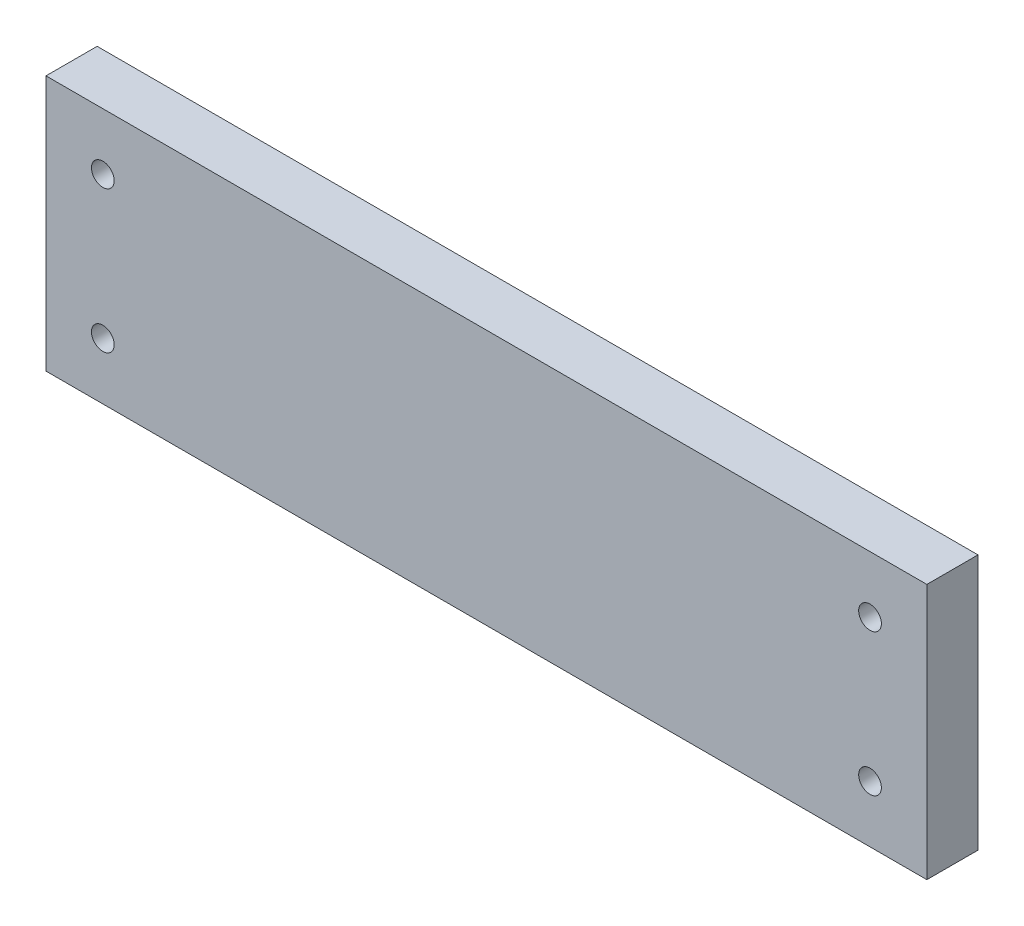
ISO-10303-21;
HEADER;
FILE_DESCRIPTION(('STEP AP214'),'2;1');
FILE_NAME('part.step','',(''),(''),'','','');
FILE_SCHEMA(('AUTOMOTIVE_DESIGN { 1 0 10303 214 1 1 1 1 }'));
ENDSEC;
DATA;
#1=APPLICATION_CONTEXT('core data for automotive mechanical design processes');
#2=APPLICATION_PROTOCOL_DEFINITION('international standard','automotive_design',2000,#1);
#3=PRODUCT_CONTEXT('',#1,'mechanical');
#4=PRODUCT('Part','Part','',(#3));
#5=PRODUCT_RELATED_PRODUCT_CATEGORY('part','',(#4));
#6=PRODUCT_DEFINITION_FORMATION('','',#4);
#7=PRODUCT_DEFINITION_CONTEXT('part definition',#1,'design');
#8=PRODUCT_DEFINITION('design','',#6,#7);
#9=PRODUCT_DEFINITION_SHAPE('','',#8);
#10=(LENGTH_UNIT() NAMED_UNIT(*) SI_UNIT(.MILLI.,.METRE.));
#11=(NAMED_UNIT(*) PLANE_ANGLE_UNIT() SI_UNIT($,.RADIAN.));
#12=(NAMED_UNIT(*) SI_UNIT($,.STERADIAN.) SOLID_ANGLE_UNIT());
#13=UNCERTAINTY_MEASURE_WITH_UNIT(LENGTH_MEASURE(1.E-05),#10,'distance_accuracy_value','');
#14=(GEOMETRIC_REPRESENTATION_CONTEXT(3) GLOBAL_UNCERTAINTY_ASSIGNED_CONTEXT((#13)) GLOBAL_UNIT_ASSIGNED_CONTEXT((#10,
#11,#12)) REPRESENTATION_CONTEXT('',''));
#15=CARTESIAN_POINT('',(0.,0.,0.));
#16=DIRECTION('',(0.,0.,1.));
#17=DIRECTION('',(1.,0.,0.));
#18=AXIS2_PLACEMENT_3D('',#15,#16,#17);
#19=CARTESIAN_POINT('',(-264.503554368159,103.028908164954,18.));
#20=DIRECTION('',(1.,0.,0.));
#21=DIRECTION('',(0.,0.,-1.));
#22=AXIS2_PLACEMENT_3D('',#19,#20,#21);
#23=PLANE('',#22);
#24=DIRECTION('',(0.,-1.,0.));
#25=VECTOR('',#24,1.);
#26=CARTESIAN_POINT('',(-264.503554368159,103.028908164954,0.));
#27=LINE('',#26,#25);
#28=CARTESIAN_POINT('',(-264.503554368159,103.028908164954,0.));
#29=VERTEX_POINT('',#28);
#30=CARTESIAN_POINT('',(-264.503554368159,13.0289081649539,0.));
#31=VERTEX_POINT('',#30);
#32=EDGE_CURVE('E101',#29,#31,#27,.T.);
#33=ORIENTED_EDGE('',*,*,#32,.T.);
#34=DIRECTION('',(0.,0.,-1.));
#35=VECTOR('',#34,1.);
#36=CARTESIAN_POINT('',(-264.503554368159,13.0289081649539,18.));
#37=LINE('',#36,#35);
#38=CARTESIAN_POINT('',(-264.503554368159,13.0289081649539,18.));
#39=VERTEX_POINT('',#38);
#40=EDGE_CURVE('E11',#39,#31,#37,.T.);
#41=ORIENTED_EDGE('',*,*,#40,.F.);
#42=DIRECTION('',(0.,-1.,0.));
#43=VECTOR('',#42,1.);
#44=CARTESIAN_POINT('',(-264.503554368159,103.028908164954,18.));
#45=LINE('',#44,#43);
#46=CARTESIAN_POINT('',(-264.503554368159,103.028908164954,18.));
#47=VERTEX_POINT('',#46);
#48=EDGE_CURVE('E88',#47,#39,#45,.T.);
#49=ORIENTED_EDGE('',*,*,#48,.F.);
#50=DIRECTION('',(0.,0.,-1.));
#51=VECTOR('',#50,1.);
#52=CARTESIAN_POINT('',(-264.503554368159,103.028908164954,18.));
#53=LINE('',#52,#51);
#54=EDGE_CURVE('E97',#47,#29,#53,.T.);
#55=ORIENTED_EDGE('',*,*,#54,.T.);
#56=EDGE_LOOP('',(#33,#41,#49,#55));
#57=FACE_BOUND('',#56,.T.);
#58=ADVANCED_FACE('F35',(#57),#23,.F.);
#59=CARTESIAN_POINT('',(-264.503554368159,13.0289081649539,18.));
#60=DIRECTION('',(0.,1.,0.));
#61=DIRECTION('',(0.,0.,1.));
#62=AXIS2_PLACEMENT_3D('',#59,#60,#61);
#63=PLANE('',#62);
#64=DIRECTION('',(1.,0.,0.));
#65=VECTOR('',#64,1.);
#66=CARTESIAN_POINT('',(-264.503554368159,13.0289081649539,0.));
#67=LINE('',#66,#65);
#68=CARTESIAN_POINT('',(45.4964456318407,13.0289081649539,0.));
#69=VERTEX_POINT('',#68);
#70=EDGE_CURVE('E92',#31,#69,#67,.T.);
#71=ORIENTED_EDGE('',*,*,#70,.T.);
#72=DIRECTION('',(0.,0.,-1.));
#73=VECTOR('',#72,1.);
#74=CARTESIAN_POINT('',(45.4964456318407,13.0289081649539,18.));
#75=LINE('',#74,#73);
#76=CARTESIAN_POINT('',(45.4964456318407,13.0289081649539,18.));
#77=VERTEX_POINT('',#76);
#78=EDGE_CURVE('E44',#77,#69,#75,.T.);
#79=ORIENTED_EDGE('',*,*,#78,.F.);
#80=DIRECTION('',(1.,0.,0.));
#81=VECTOR('',#80,1.);
#82=CARTESIAN_POINT('',(-264.503554368159,13.0289081649539,18.));
#83=LINE('',#82,#81);
#84=EDGE_CURVE('E83',#39,#77,#83,.T.);
#85=ORIENTED_EDGE('',*,*,#84,.F.);
#86=ORIENTED_EDGE('',*,*,#40,.T.);
#87=EDGE_LOOP('',(#71,#79,#85,#86));
#88=FACE_BOUND('',#87,.T.);
#89=ADVANCED_FACE('F91',(#88),#63,.F.);
#90=CARTESIAN_POINT('',(45.4964456318407,103.028908164954,18.));
#91=DIRECTION('',(-1.,0.,0.));
#92=DIRECTION('',(0.,-1.,0.));
#93=AXIS2_PLACEMENT_3D('',#90,#91,#92);
#94=PLANE('',#93);
#95=DIRECTION('',(0.,1.,0.));
#96=VECTOR('',#95,1.);
#97=CARTESIAN_POINT('',(45.4964456318407,103.028908164954,0.));
#98=LINE('',#97,#96);
#99=CARTESIAN_POINT('',(45.4964456318407,103.028908164954,0.));
#100=VERTEX_POINT('',#99);
#101=EDGE_CURVE('E70',#69,#100,#98,.T.);
#102=ORIENTED_EDGE('',*,*,#101,.T.);
#103=DIRECTION('',(0.,0.,-1.));
#104=VECTOR('',#103,1.);
#105=CARTESIAN_POINT('',(45.4964456318407,103.028908164954,18.));
#106=LINE('',#105,#104);
#107=CARTESIAN_POINT('',(45.4964456318407,103.028908164954,18.));
#108=VERTEX_POINT('',#107);
#109=EDGE_CURVE('E93',#108,#100,#106,.T.);
#110=ORIENTED_EDGE('',*,*,#109,.F.);
#111=DIRECTION('',(0.,1.,0.));
#112=VECTOR('',#111,1.);
#113=CARTESIAN_POINT('',(45.4964456318407,103.028908164954,18.));
#114=LINE('',#113,#112);
#115=EDGE_CURVE('E86',#77,#108,#114,.T.);
#116=ORIENTED_EDGE('',*,*,#115,.F.);
#117=ORIENTED_EDGE('',*,*,#78,.T.);
#118=EDGE_LOOP('',(#102,#110,#116,#117));
#119=FACE_BOUND('',#118,.T.);
#120=ADVANCED_FACE('F95',(#119),#94,.F.);
#121=CARTESIAN_POINT('',(-264.503554368159,103.028908164954,18.));
#122=DIRECTION('',(0.,-1.,0.));
#123=DIRECTION('',(0.,0.,-1.));
#124=AXIS2_PLACEMENT_3D('',#121,#122,#123);
#125=PLANE('',#124);
#126=DIRECTION('',(-1.,0.,0.));
#127=VECTOR('',#126,1.);
#128=CARTESIAN_POINT('',(-264.503554368159,103.028908164954,0.));
#129=LINE('',#128,#127);
#130=EDGE_CURVE('E76',#100,#29,#129,.T.);
#131=ORIENTED_EDGE('',*,*,#130,.T.);
#132=ORIENTED_EDGE('',*,*,#54,.F.);
#133=DIRECTION('',(-1.,0.,0.));
#134=VECTOR('',#133,1.);
#135=CARTESIAN_POINT('',(-264.503554368159,103.028908164954,18.));
#136=LINE('',#135,#134);
#137=EDGE_CURVE('E53',#108,#47,#136,.T.);
#138=ORIENTED_EDGE('',*,*,#137,.F.);
#139=ORIENTED_EDGE('',*,*,#109,.T.);
#140=EDGE_LOOP('',(#131,#132,#138,#139));
#141=FACE_BOUND('',#140,.T.);
#142=ADVANCED_FACE('F139',(#141),#125,.F.);
#143=CARTESIAN_POINT('',(0.,0.,18.));
#144=DIRECTION('',(0.,0.,1.));
#145=DIRECTION('',(1.,0.,0.));
#146=AXIS2_PLACEMENT_3D('',#143,#144,#145);
#147=PLANE('',#146);
#148=CARTESIAN_POINT('',(-244.503554368159,83.0289081649539,18.));
#149=DIRECTION('',(0.,0.,1.));
#150=DIRECTION('',(1.,0.,0.));
#151=AXIS2_PLACEMENT_3D('',#148,#149,#150);
#152=CIRCLE('',#151,3.99999999999999);
#153=CARTESIAN_POINT('',(-240.503554368159,83.0289081649539,18.));
#154=VERTEX_POINT('',#153);
#155=EDGE_CURVE('E128',#154,#154,#152,.T.);
#156=ORIENTED_EDGE('',*,*,#155,.F.);
#157=EDGE_LOOP('',(#156));
#158=FACE_BOUND('',#157,.T.);
#159=CARTESIAN_POINT('',(-244.503554368159,33.0289081649539,18.));
#160=DIRECTION('',(0.,0.,1.));
#161=DIRECTION('',(1.,0.,0.));
#162=AXIS2_PLACEMENT_3D('',#159,#160,#161);
#163=CIRCLE('',#162,3.99999999999999);
#164=CARTESIAN_POINT('',(-240.503554368159,33.0289081649539,18.));
#165=VERTEX_POINT('',#164);
#166=EDGE_CURVE('E118',#165,#165,#163,.T.);
#167=ORIENTED_EDGE('',*,*,#166,.F.);
#168=EDGE_LOOP('',(#167));
#169=FACE_BOUND('',#168,.T.);
#170=CARTESIAN_POINT('',(25.4964456318407,33.0289081649539,18.));
#171=DIRECTION('',(0.,0.,1.));
#172=DIRECTION('',(1.,0.,0.));
#173=AXIS2_PLACEMENT_3D('',#170,#171,#172);
#174=CIRCLE('',#173,4.);
#175=CARTESIAN_POINT('',(29.4964456318407,33.0289081649539,18.));
#176=VERTEX_POINT('',#175);
#177=EDGE_CURVE('E115',#176,#176,#174,.T.);
#178=ORIENTED_EDGE('',*,*,#177,.F.);
#179=EDGE_LOOP('',(#178));
#180=FACE_BOUND('',#179,.T.);
#181=CARTESIAN_POINT('',(25.4964456318407,83.0289081649539,18.));
#182=DIRECTION('',(0.,0.,1.));
#183=DIRECTION('',(1.,0.,0.));
#184=AXIS2_PLACEMENT_3D('',#181,#182,#183);
#185=CIRCLE('',#184,4.);
#186=CARTESIAN_POINT('',(29.4964456318407,83.0289081649539,18.));
#187=VERTEX_POINT('',#186);
#188=EDGE_CURVE('E112',#187,#187,#185,.T.);
#189=ORIENTED_EDGE('',*,*,#188,.F.);
#190=EDGE_LOOP('',(#189));
#191=FACE_BOUND('',#190,.T.);
#192=ORIENTED_EDGE('',*,*,#48,.T.);
#193=ORIENTED_EDGE('',*,*,#84,.T.);
#194=ORIENTED_EDGE('',*,*,#115,.T.);
#195=ORIENTED_EDGE('',*,*,#137,.T.);
#196=EDGE_LOOP('',(#192,#193,#194,#195));
#197=FACE_BOUND('',#196,.T.);
#198=ADVANCED_FACE('F84',(#158,#169,#180,#191,#197),#147,.T.);
#199=CARTESIAN_POINT('',(0.,0.,0.));
#200=DIRECTION('',(0.,0.,1.));
#201=DIRECTION('',(1.,0.,0.));
#202=AXIS2_PLACEMENT_3D('',#199,#200,#201);
#203=PLANE('',#202);
#204=CARTESIAN_POINT('',(-244.503554368159,83.0289081649539,0.));
#205=DIRECTION('',(0.,0.,1.));
#206=DIRECTION('',(1.,0.,0.));
#207=AXIS2_PLACEMENT_3D('',#204,#205,#206);
#208=CIRCLE('',#207,3.99999999999999);
#209=CARTESIAN_POINT('',(-240.503554368159,83.0289081649539,0.));
#210=VERTEX_POINT('',#209);
#211=EDGE_CURVE('E38',#210,#210,#208,.T.);
#212=ORIENTED_EDGE('',*,*,#211,.T.);
#213=EDGE_LOOP('',(#212));
#214=FACE_BOUND('',#213,.T.);
#215=CARTESIAN_POINT('',(-244.503554368159,33.0289081649539,0.));
#216=DIRECTION('',(0.,0.,1.));
#217=DIRECTION('',(1.,0.,0.));
#218=AXIS2_PLACEMENT_3D('',#215,#216,#217);
#219=CIRCLE('',#218,3.99999999999999);
#220=CARTESIAN_POINT('',(-240.503554368159,33.0289081649539,0.));
#221=VERTEX_POINT('',#220);
#222=EDGE_CURVE('E116',#221,#221,#219,.T.);
#223=ORIENTED_EDGE('',*,*,#222,.T.);
#224=EDGE_LOOP('',(#223));
#225=FACE_BOUND('',#224,.T.);
#226=CARTESIAN_POINT('',(25.4964456318407,33.0289081649539,0.));
#227=DIRECTION('',(0.,0.,1.));
#228=DIRECTION('',(1.,0.,0.));
#229=AXIS2_PLACEMENT_3D('',#226,#227,#228);
#230=CIRCLE('',#229,4.);
#231=CARTESIAN_POINT('',(29.4964456318407,33.0289081649539,0.));
#232=VERTEX_POINT('',#231);
#233=EDGE_CURVE('E113',#232,#232,#230,.T.);
#234=ORIENTED_EDGE('',*,*,#233,.T.);
#235=EDGE_LOOP('',(#234));
#236=FACE_BOUND('',#235,.T.);
#237=CARTESIAN_POINT('',(25.4964456318407,83.0289081649539,0.));
#238=DIRECTION('',(0.,0.,1.));
#239=DIRECTION('',(1.,0.,0.));
#240=AXIS2_PLACEMENT_3D('',#237,#238,#239);
#241=CIRCLE('',#240,4.);
#242=CARTESIAN_POINT('',(29.4964456318407,83.0289081649539,0.));
#243=VERTEX_POINT('',#242);
#244=EDGE_CURVE('E104',#243,#243,#241,.T.);
#245=ORIENTED_EDGE('',*,*,#244,.T.);
#246=EDGE_LOOP('',(#245));
#247=FACE_BOUND('',#246,.T.);
#248=ORIENTED_EDGE('',*,*,#32,.F.);
#249=ORIENTED_EDGE('',*,*,#130,.F.);
#250=ORIENTED_EDGE('',*,*,#101,.F.);
#251=ORIENTED_EDGE('',*,*,#70,.F.);
#252=EDGE_LOOP('',(#248,#249,#250,#251));
#253=FACE_BOUND('',#252,.T.);
#254=ADVANCED_FACE('F138',(#214,#225,#236,#247,#253),#203,.F.);
#255=CARTESIAN_POINT('',(25.4964456318407,83.0289081649539,-5.));
#256=DIRECTION('',(0.,0.,1.));
#257=DIRECTION('',(1.,0.,0.));
#258=AXIS2_PLACEMENT_3D('',#255,#256,#257);
#259=CYLINDRICAL_SURFACE('',#258,4.);
#260=ORIENTED_EDGE('',*,*,#188,.T.);
#261=EDGE_LOOP('',(#260));
#262=FACE_BOUND('',#261,.T.);
#263=ORIENTED_EDGE('',*,*,#244,.F.);
#264=EDGE_LOOP('',(#263));
#265=FACE_BOUND('',#264,.T.);
#266=ADVANCED_FACE('F134',(#262,#265),#259,.F.);
#267=CARTESIAN_POINT('',(25.4964456318407,33.0289081649539,-5.));
#268=DIRECTION('',(0.,0.,1.));
#269=DIRECTION('',(1.,0.,0.));
#270=AXIS2_PLACEMENT_3D('',#267,#268,#269);
#271=CYLINDRICAL_SURFACE('',#270,4.);
#272=ORIENTED_EDGE('',*,*,#177,.T.);
#273=EDGE_LOOP('',(#272));
#274=FACE_BOUND('',#273,.T.);
#275=ORIENTED_EDGE('',*,*,#233,.F.);
#276=EDGE_LOOP('',(#275));
#277=FACE_BOUND('',#276,.T.);
#278=ADVANCED_FACE('F188',(#274,#277),#271,.F.);
#279=CARTESIAN_POINT('',(-244.503554368159,33.0289081649539,-5.));
#280=DIRECTION('',(0.,0.,1.));
#281=DIRECTION('',(1.,0.,0.));
#282=AXIS2_PLACEMENT_3D('',#279,#280,#281);
#283=CYLINDRICAL_SURFACE('',#282,3.99999999999999);
#284=ORIENTED_EDGE('',*,*,#166,.T.);
#285=EDGE_LOOP('',(#284));
#286=FACE_BOUND('',#285,.T.);
#287=ORIENTED_EDGE('',*,*,#222,.F.);
#288=EDGE_LOOP('',(#287));
#289=FACE_BOUND('',#288,.T.);
#290=ADVANCED_FACE('F196',(#286,#289),#283,.F.);
#291=CARTESIAN_POINT('',(-244.503554368159,83.0289081649539,-5.));
#292=DIRECTION('',(0.,0.,1.));
#293=DIRECTION('',(1.,0.,0.));
#294=AXIS2_PLACEMENT_3D('',#291,#292,#293);
#295=CYLINDRICAL_SURFACE('',#294,3.99999999999999);
#296=ORIENTED_EDGE('',*,*,#155,.T.);
#297=EDGE_LOOP('',(#296));
#298=FACE_BOUND('',#297,.T.);
#299=ORIENTED_EDGE('',*,*,#211,.F.);
#300=EDGE_LOOP('',(#299));
#301=FACE_BOUND('',#300,.T.);
#302=ADVANCED_FACE('F206',(#298,#301),#295,.F.);
#303=CLOSED_SHELL('',(#58,#89,#120,#142,#198,#254,#266,#278,#290,#302));
#304=MANIFOLD_SOLID_BREP('B2',#303);
#305=ADVANCED_BREP_SHAPE_REPRESENTATION('',(#18,#304),#14);
#306=SHAPE_DEFINITION_REPRESENTATION(#9,#305);
ENDSEC;
END-ISO-10303-21;
